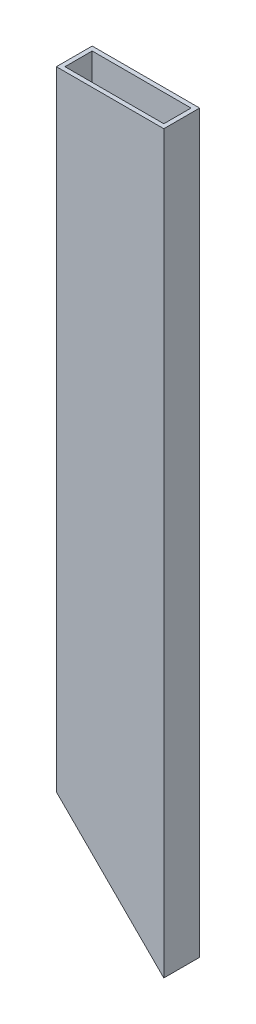
ISO-10303-21;
HEADER;
FILE_DESCRIPTION(('STEP AP214'),'2;1');
FILE_NAME('part.step','',(''),(''),'','','');
FILE_SCHEMA(('AUTOMOTIVE_DESIGN { 1 0 10303 214 1 1 1 1 }'));
ENDSEC;
DATA;
#1=APPLICATION_CONTEXT('core data for automotive mechanical design processes');
#2=APPLICATION_PROTOCOL_DEFINITION('international standard','automotive_design',2000,#1);
#3=PRODUCT_CONTEXT('',#1,'mechanical');
#4=PRODUCT('Part','Part','',(#3));
#5=PRODUCT_RELATED_PRODUCT_CATEGORY('part','',(#4));
#6=PRODUCT_DEFINITION_FORMATION('','',#4);
#7=PRODUCT_DEFINITION_CONTEXT('part definition',#1,'design');
#8=PRODUCT_DEFINITION('design','',#6,#7);
#9=PRODUCT_DEFINITION_SHAPE('','',#8);
#10=(LENGTH_UNIT() NAMED_UNIT(*) SI_UNIT(.MILLI.,.METRE.));
#11=(NAMED_UNIT(*) PLANE_ANGLE_UNIT() SI_UNIT($,.RADIAN.));
#12=(NAMED_UNIT(*) SI_UNIT($,.STERADIAN.) SOLID_ANGLE_UNIT());
#13=UNCERTAINTY_MEASURE_WITH_UNIT(LENGTH_MEASURE(1.E-05),#10,'distance_accuracy_value','');
#14=(GEOMETRIC_REPRESENTATION_CONTEXT(3) GLOBAL_UNCERTAINTY_ASSIGNED_CONTEXT((#13)) GLOBAL_UNIT_ASSIGNED_CONTEXT((#10,
#11,#12)) REPRESENTATION_CONTEXT('',''));
#15=CARTESIAN_POINT('',(0.,0.,0.));
#16=DIRECTION('',(0.,0.,1.));
#17=DIRECTION('',(1.,0.,0.));
#18=AXIS2_PLACEMENT_3D('',#15,#16,#17);
#19=CARTESIAN_POINT('',(-38.1,445.4,-12.7));
#20=DIRECTION('',(1.,0.,0.));
#21=DIRECTION('',(0.,0.,-1.));
#22=AXIS2_PLACEMENT_3D('',#19,#20,#21);
#23=PLANE('',#22);
#24=DIRECTION('',(0.,-1.,0.));
#25=VECTOR('',#24,1.);
#26=CARTESIAN_POINT('',(-38.1,445.4,-12.7));
#27=LINE('',#26,#25);
#28=CARTESIAN_POINT('',(-38.1,483.5,-12.7));
#29=VERTEX_POINT('',#28);
#30=CARTESIAN_POINT('',(-38.1000000000001,38.0999999999999,-12.7));
#31=VERTEX_POINT('',#30);
#32=EDGE_CURVE('E110',#29,#31,#27,.T.);
#33=ORIENTED_EDGE('',*,*,#32,.T.);
#34=DIRECTION('',(0.,0.,1.));
#35=VECTOR('',#34,1.);
#36=CARTESIAN_POINT('',(-38.1,38.0999999999999,-12.7));
#37=LINE('',#36,#35);
#38=CARTESIAN_POINT('',(-38.1000000000001,38.0999999999999,12.7));
#39=VERTEX_POINT('',#38);
#40=EDGE_CURVE('E98',#31,#39,#37,.T.);
#41=ORIENTED_EDGE('',*,*,#40,.T.);
#42=DIRECTION('',(0.,-1.,0.));
#43=VECTOR('',#42,1.);
#44=CARTESIAN_POINT('',(-38.1,445.4,12.7));
#45=LINE('',#44,#43);
#46=CARTESIAN_POINT('',(-38.1,483.5,12.7));
#47=VERTEX_POINT('',#46);
#48=EDGE_CURVE('E11',#47,#39,#45,.T.);
#49=ORIENTED_EDGE('',*,*,#48,.F.);
#50=DIRECTION('',(0.,0.,1.));
#51=VECTOR('',#50,1.);
#52=CARTESIAN_POINT('',(-38.1,483.5,-12.7));
#53=LINE('',#52,#51);
#54=EDGE_CURVE('E116',#29,#47,#53,.T.);
#55=ORIENTED_EDGE('',*,*,#54,.F.);
#56=EDGE_LOOP('',(#33,#41,#49,#55));
#57=FACE_BOUND('',#56,.T.);
#58=ADVANCED_FACE('F36',(#57),#23,.F.);
#59=CARTESIAN_POINT('',(-38.1,445.4,12.7));
#60=DIRECTION('',(0.,0.,-1.));
#61=DIRECTION('',(-1.,0.,0.));
#62=AXIS2_PLACEMENT_3D('',#59,#60,#61);
#63=PLANE('',#62);
#64=ORIENTED_EDGE('',*,*,#48,.T.);
#65=DIRECTION('',(0.707106781186548,-0.707106781186548,0.));
#66=VECTOR('',#65,1.);
#67=CARTESIAN_POINT('',(107.156068894915,-107.156068894915,12.7));
#68=LINE('',#67,#66);
#69=CARTESIAN_POINT('',(38.0999999999999,-38.1,12.7));
#70=VERTEX_POINT('',#69);
#71=EDGE_CURVE('E101',#39,#70,#68,.T.);
#72=ORIENTED_EDGE('',*,*,#71,.T.);
#73=DIRECTION('',(0.,-1.,0.));
#74=VECTOR('',#73,1.);
#75=CARTESIAN_POINT('',(38.1,445.4,12.7));
#76=LINE('',#75,#74);
#77=CARTESIAN_POINT('',(38.1,483.5,12.7));
#78=VERTEX_POINT('',#77);
#79=EDGE_CURVE('E43',#78,#70,#76,.T.);
#80=ORIENTED_EDGE('',*,*,#79,.F.);
#81=DIRECTION('',(1.,0.,0.));
#82=VECTOR('',#81,1.);
#83=CARTESIAN_POINT('',(-38.1,483.5,12.7));
#84=LINE('',#83,#82);
#85=EDGE_CURVE('E136',#47,#78,#84,.T.);
#86=ORIENTED_EDGE('',*,*,#85,.F.);
#87=EDGE_LOOP('',(#64,#72,#80,#86));
#88=FACE_BOUND('',#87,.T.);
#89=ADVANCED_FACE('F135',(#88),#63,.F.);
#90=CARTESIAN_POINT('',(38.1,445.4,-12.7));
#91=DIRECTION('',(-1.,0.,0.));
#92=DIRECTION('',(0.,0.,1.));
#93=AXIS2_PLACEMENT_3D('',#90,#91,#92);
#94=PLANE('',#93);
#95=ORIENTED_EDGE('',*,*,#79,.T.);
#96=DIRECTION('',(0.,0.,1.));
#97=VECTOR('',#96,1.);
#98=CARTESIAN_POINT('',(38.1,-38.1,12.7));
#99=LINE('',#98,#97);
#100=CARTESIAN_POINT('',(38.1,-38.1,-12.7));
#101=VERTEX_POINT('',#100);
#102=EDGE_CURVE('E129',#101,#70,#99,.T.);
#103=ORIENTED_EDGE('',*,*,#102,.F.);
#104=DIRECTION('',(0.,-1.,0.));
#105=VECTOR('',#104,1.);
#106=CARTESIAN_POINT('',(38.1,445.4,-12.7));
#107=LINE('',#106,#105);
#108=CARTESIAN_POINT('',(38.1,483.5,-12.7));
#109=VERTEX_POINT('',#108);
#110=EDGE_CURVE('E112',#109,#101,#107,.T.);
#111=ORIENTED_EDGE('',*,*,#110,.F.);
#112=DIRECTION('',(0.,0.,-1.));
#113=VECTOR('',#112,1.);
#114=CARTESIAN_POINT('',(38.1,483.5,12.7));
#115=LINE('',#114,#113);
#116=EDGE_CURVE('E131',#78,#109,#115,.T.);
#117=ORIENTED_EDGE('',*,*,#116,.F.);
#118=EDGE_LOOP('',(#95,#103,#111,#117));
#119=FACE_BOUND('',#118,.T.);
#120=ADVANCED_FACE('F128',(#119),#94,.F.);
#121=CARTESIAN_POINT('',(-38.1,445.4,-12.7));
#122=DIRECTION('',(0.,0.,1.));
#123=DIRECTION('',(1.,0.,0.));
#124=AXIS2_PLACEMENT_3D('',#121,#122,#123);
#125=PLANE('',#124);
#126=ORIENTED_EDGE('',*,*,#110,.T.);
#127=DIRECTION('',(0.707106781186548,-0.707106781186548,0.));
#128=VECTOR('',#127,1.);
#129=CARTESIAN_POINT('',(107.156068894915,-107.156068894915,-12.7));
#130=LINE('',#129,#128);
#131=EDGE_CURVE('E58',#31,#101,#130,.T.);
#132=ORIENTED_EDGE('',*,*,#131,.F.);
#133=ORIENTED_EDGE('',*,*,#32,.F.);
#134=DIRECTION('',(-1.,0.,0.));
#135=VECTOR('',#134,1.);
#136=CARTESIAN_POINT('',(38.1,483.5,-12.7));
#137=LINE('',#136,#135);
#138=EDGE_CURVE('E142',#109,#29,#137,.T.);
#139=ORIENTED_EDGE('',*,*,#138,.F.);
#140=EDGE_LOOP('',(#126,#132,#133,#139));
#141=FACE_BOUND('',#140,.T.);
#142=ADVANCED_FACE('F108',(#141),#125,.F.);
#143=CARTESIAN_POINT('',(-35.052,445.4,-9.65199999999999));
#144=DIRECTION('',(1.,0.,0.));
#145=DIRECTION('',(0.,0.,-1.));
#146=AXIS2_PLACEMENT_3D('',#143,#144,#145);
#147=PLANE('',#146);
#148=DIRECTION('',(0.,0.,1.));
#149=VECTOR('',#148,1.);
#150=CARTESIAN_POINT('',(-35.052,35.0519999999999,-9.65199999999999));
#151=LINE('',#150,#149);
#152=CARTESIAN_POINT('',(-35.052,35.0519999999998,-9.65199999999999));
#153=VERTEX_POINT('',#152);
#154=CARTESIAN_POINT('',(-35.052,35.0519999999998,9.652));
#155=VERTEX_POINT('',#154);
#156=EDGE_CURVE('E105',#153,#155,#151,.T.);
#157=ORIENTED_EDGE('',*,*,#156,.F.);
#158=DIRECTION('',(0.,-1.,0.));
#159=VECTOR('',#158,1.);
#160=CARTESIAN_POINT('',(-35.052,445.4,-9.65199999999999));
#161=LINE('',#160,#159);
#162=CARTESIAN_POINT('',(-35.052,483.5,-9.65199999999999));
#163=VERTEX_POINT('',#162);
#164=EDGE_CURVE('E147',#163,#153,#161,.T.);
#165=ORIENTED_EDGE('',*,*,#164,.F.);
#166=DIRECTION('',(0.,0.,1.));
#167=VECTOR('',#166,1.);
#168=CARTESIAN_POINT('',(-35.052,483.5,-9.65199999999999));
#169=LINE('',#168,#167);
#170=CARTESIAN_POINT('',(-35.052,483.5,9.652));
#171=VERTEX_POINT('',#170);
#172=EDGE_CURVE('E177',#163,#171,#169,.T.);
#173=ORIENTED_EDGE('',*,*,#172,.T.);
#174=DIRECTION('',(0.,-1.,0.));
#175=VECTOR('',#174,1.);
#176=CARTESIAN_POINT('',(-35.052,445.4,9.652));
#177=LINE('',#176,#175);
#178=EDGE_CURVE('E118',#171,#155,#177,.T.);
#179=ORIENTED_EDGE('',*,*,#178,.T.);
#180=EDGE_LOOP('',(#157,#165,#173,#179));
#181=FACE_BOUND('',#180,.T.);
#182=ADVANCED_FACE('F182',(#181),#147,.T.);
#183=CARTESIAN_POINT('',(-35.052,445.4,9.652));
#184=DIRECTION('',(0.,0.,-1.));
#185=DIRECTION('',(-1.,0.,0.));
#186=AXIS2_PLACEMENT_3D('',#183,#184,#185);
#187=PLANE('',#186);
#188=DIRECTION('',(0.707106781186548,-0.707106781186547,0.));
#189=VECTOR('',#188,1.);
#190=CARTESIAN_POINT('',(-240.226,240.226,9.65200000000003));
#191=LINE('',#190,#189);
#192=CARTESIAN_POINT('',(35.052,-35.0520000000002,9.65199999999999));
#193=VERTEX_POINT('',#192);
#194=EDGE_CURVE('E157',#155,#193,#191,.T.);
#195=ORIENTED_EDGE('',*,*,#194,.F.);
#196=ORIENTED_EDGE('',*,*,#178,.F.);
#197=DIRECTION('',(1.,0.,0.));
#198=VECTOR('',#197,1.);
#199=CARTESIAN_POINT('',(-35.052,483.5,9.652));
#200=LINE('',#199,#198);
#201=CARTESIAN_POINT('',(35.052,483.5,9.65199999999999));
#202=VERTEX_POINT('',#201);
#203=EDGE_CURVE('E104',#171,#202,#200,.T.);
#204=ORIENTED_EDGE('',*,*,#203,.T.);
#205=DIRECTION('',(0.,-1.,0.));
#206=VECTOR('',#205,1.);
#207=CARTESIAN_POINT('',(35.052,445.4,9.65199999999999));
#208=LINE('',#207,#206);
#209=EDGE_CURVE('E122',#202,#193,#208,.T.);
#210=ORIENTED_EDGE('',*,*,#209,.T.);
#211=EDGE_LOOP('',(#195,#196,#204,#210));
#212=FACE_BOUND('',#211,.T.);
#213=ADVANCED_FACE('F156',(#212),#187,.T.);
#214=CARTESIAN_POINT('',(35.052,445.4,-9.652));
#215=DIRECTION('',(-1.,0.,0.));
#216=DIRECTION('',(0.,0.,1.));
#217=AXIS2_PLACEMENT_3D('',#214,#215,#216);
#218=PLANE('',#217);
#219=DIRECTION('',(0.,0.,-1.));
#220=VECTOR('',#219,1.);
#221=CARTESIAN_POINT('',(35.052,-35.0520000000002,-9.652));
#222=LINE('',#221,#220);
#223=CARTESIAN_POINT('',(35.052,-35.0520000000001,-9.652));
#224=VERTEX_POINT('',#223);
#225=EDGE_CURVE('E50',#193,#224,#222,.T.);
#226=ORIENTED_EDGE('',*,*,#225,.F.);
#227=ORIENTED_EDGE('',*,*,#209,.F.);
#228=DIRECTION('',(0.,0.,-1.));
#229=VECTOR('',#228,1.);
#230=CARTESIAN_POINT('',(35.052,483.5,9.65199999999999));
#231=LINE('',#230,#229);
#232=CARTESIAN_POINT('',(35.052,483.5,-9.652));
#233=VERTEX_POINT('',#232);
#234=EDGE_CURVE('E163',#202,#233,#231,.T.);
#235=ORIENTED_EDGE('',*,*,#234,.T.);
#236=DIRECTION('',(0.,-1.,0.));
#237=VECTOR('',#236,1.);
#238=CARTESIAN_POINT('',(35.052,445.4,-9.652));
#239=LINE('',#238,#237);
#240=EDGE_CURVE('E150',#233,#224,#239,.T.);
#241=ORIENTED_EDGE('',*,*,#240,.T.);
#242=EDGE_LOOP('',(#226,#227,#235,#241));
#243=FACE_BOUND('',#242,.T.);
#244=ADVANCED_FACE('F162',(#243),#218,.T.);
#245=CARTESIAN_POINT('',(-35.052,445.4,-9.65199999999999));
#246=DIRECTION('',(0.,0.,1.));
#247=DIRECTION('',(1.,0.,0.));
#248=AXIS2_PLACEMENT_3D('',#245,#246,#247);
#249=PLANE('',#248);
#250=DIRECTION('',(-0.707106781186548,0.707106781186547,0.));
#251=VECTOR('',#250,1.);
#252=CARTESIAN_POINT('',(-240.226,240.226,-9.65199999999996));
#253=LINE('',#252,#251);
#254=EDGE_CURVE('E165',#224,#153,#253,.T.);
#255=ORIENTED_EDGE('',*,*,#254,.F.);
#256=ORIENTED_EDGE('',*,*,#240,.F.);
#257=DIRECTION('',(-1.,0.,0.));
#258=VECTOR('',#257,1.);
#259=CARTESIAN_POINT('',(35.052,483.5,-9.652));
#260=LINE('',#259,#258);
#261=EDGE_CURVE('E174',#233,#163,#260,.T.);
#262=ORIENTED_EDGE('',*,*,#261,.T.);
#263=ORIENTED_EDGE('',*,*,#164,.T.);
#264=EDGE_LOOP('',(#255,#256,#262,#263));
#265=FACE_BOUND('',#264,.T.);
#266=ADVANCED_FACE('F184',(#265),#249,.T.);
#267=CARTESIAN_POINT('',(0.,483.5,0.));
#268=DIRECTION('',(0.,1.,0.));
#269=DIRECTION('',(0.,0.,1.));
#270=AXIS2_PLACEMENT_3D('',#267,#268,#269);
#271=PLANE('',#270);
#272=ORIENTED_EDGE('',*,*,#138,.T.);
#273=ORIENTED_EDGE('',*,*,#54,.T.);
#274=ORIENTED_EDGE('',*,*,#85,.T.);
#275=ORIENTED_EDGE('',*,*,#116,.T.);
#276=EDGE_LOOP('',(#272,#273,#274,#275));
#277=FACE_BOUND('',#276,.T.);
#278=ORIENTED_EDGE('',*,*,#234,.F.);
#279=ORIENTED_EDGE('',*,*,#203,.F.);
#280=ORIENTED_EDGE('',*,*,#172,.F.);
#281=ORIENTED_EDGE('',*,*,#261,.F.);
#282=EDGE_LOOP('',(#278,#279,#280,#281));
#283=FACE_BOUND('',#282,.T.);
#284=ADVANCED_FACE('F138',(#277,#283),#271,.T.);
#285=CARTESIAN_POINT('',(107.156068894915,-107.156068894915,12.7));
#286=DIRECTION('',(0.707106781186547,0.707106781186548,0.));
#287=DIRECTION('',(-0.707106781186548,0.707106781186547,0.));
#288=AXIS2_PLACEMENT_3D('',#285,#286,#287);
#289=PLANE('',#288);
#290=ORIENTED_EDGE('',*,*,#156,.T.);
#291=ORIENTED_EDGE('',*,*,#194,.T.);
#292=ORIENTED_EDGE('',*,*,#225,.T.);
#293=ORIENTED_EDGE('',*,*,#254,.T.);
#294=EDGE_LOOP('',(#290,#291,#292,#293));
#295=FACE_BOUND('',#294,.T.);
#296=ORIENTED_EDGE('',*,*,#131,.T.);
#297=ORIENTED_EDGE('',*,*,#102,.T.);
#298=ORIENTED_EDGE('',*,*,#71,.F.);
#299=ORIENTED_EDGE('',*,*,#40,.F.);
#300=EDGE_LOOP('',(#296,#297,#298,#299));
#301=FACE_BOUND('',#300,.T.);
#302=ADVANCED_FACE('F99',(#295,#301),#289,.F.);
#303=CLOSED_SHELL('',(#58,#89,#120,#142,#182,#213,#244,#266,#284,#302));
#304=MANIFOLD_SOLID_BREP('B2',#303);
#305=ADVANCED_BREP_SHAPE_REPRESENTATION('',(#18,#304),#14);
#306=SHAPE_DEFINITION_REPRESENTATION(#9,#305);
ENDSEC;
END-ISO-10303-21;
